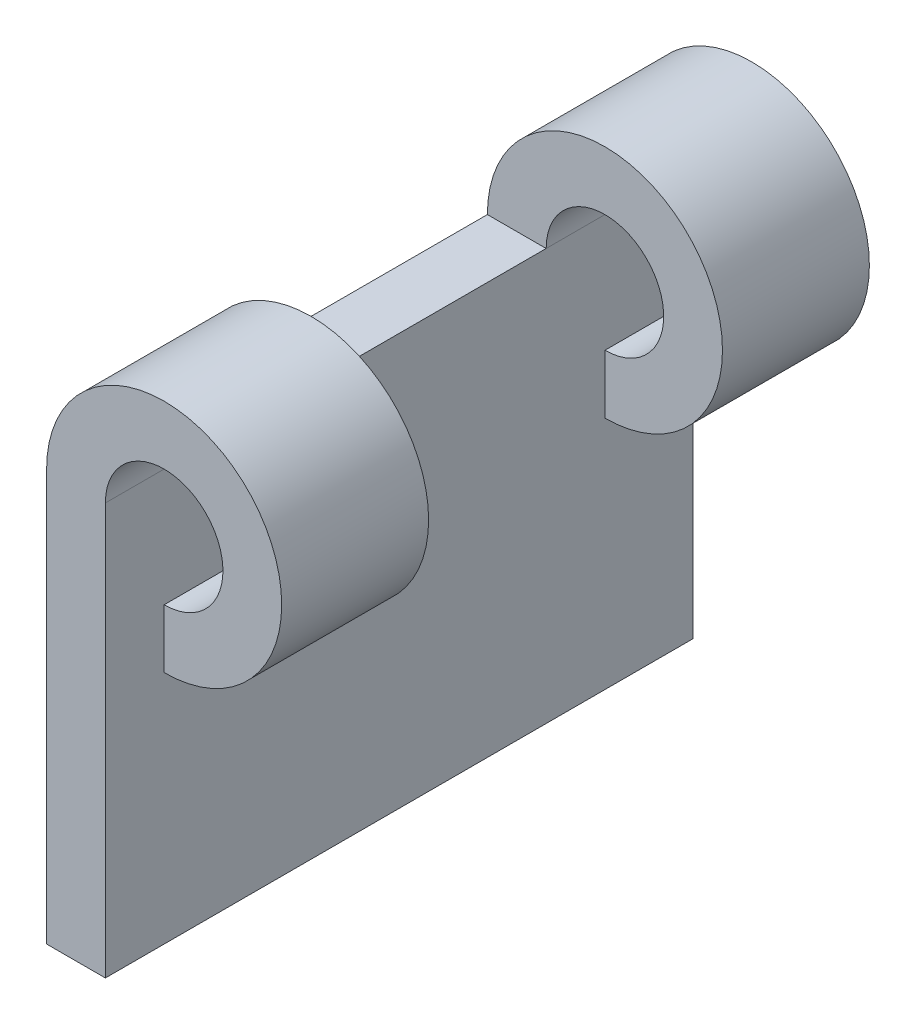
ISO-10303-21;
HEADER;
FILE_DESCRIPTION(('STEP AP214'),'2;1');
FILE_NAME('part.step','',(''),(''),'','','');
FILE_SCHEMA(('AUTOMOTIVE_DESIGN { 1 0 10303 214 1 1 1 1 }'));
ENDSEC;
DATA;
#1=APPLICATION_CONTEXT('core data for automotive mechanical design processes');
#2=APPLICATION_PROTOCOL_DEFINITION('international standard','automotive_design',2000,#1);
#3=PRODUCT_CONTEXT('',#1,'mechanical');
#4=PRODUCT('Part','Part','',(#3));
#5=PRODUCT_RELATED_PRODUCT_CATEGORY('part','',(#4));
#6=PRODUCT_DEFINITION_FORMATION('','',#4);
#7=PRODUCT_DEFINITION_CONTEXT('part definition',#1,'design');
#8=PRODUCT_DEFINITION('design','',#6,#7);
#9=PRODUCT_DEFINITION_SHAPE('','',#8);
#10=(LENGTH_UNIT() NAMED_UNIT(*) SI_UNIT(.MILLI.,.METRE.));
#11=(NAMED_UNIT(*) PLANE_ANGLE_UNIT() SI_UNIT($,.RADIAN.));
#12=(NAMED_UNIT(*) SI_UNIT($,.STERADIAN.) SOLID_ANGLE_UNIT());
#13=UNCERTAINTY_MEASURE_WITH_UNIT(LENGTH_MEASURE(1.E-05),#10,'distance_accuracy_value','');
#14=(GEOMETRIC_REPRESENTATION_CONTEXT(3) GLOBAL_UNCERTAINTY_ASSIGNED_CONTEXT((#13)) GLOBAL_UNIT_ASSIGNED_CONTEXT((#10,
#11,#12)) REPRESENTATION_CONTEXT('',''));
#15=CARTESIAN_POINT('',(0.,0.,0.));
#16=DIRECTION('',(0.,0.,1.));
#17=DIRECTION('',(1.,0.,0.));
#18=AXIS2_PLACEMENT_3D('',#15,#16,#17);
#19=CARTESIAN_POINT('',(4.,14.,5.));
#20=DIRECTION('',(0.,0.,-1.));
#21=DIRECTION('',(-1.,0.,0.));
#22=AXIS2_PLACEMENT_3D('',#19,#20,#21);
#23=CYLINDRICAL_SURFACE('',#22,2.);
#24=CARTESIAN_POINT('',(4.,14.,0.));
#25=DIRECTION('',(0.,0.,1.));
#26=DIRECTION('',(1.,0.,0.));
#27=AXIS2_PLACEMENT_3D('',#24,#25,#26);
#28=CIRCLE('',#27,2.);
#29=CARTESIAN_POINT('',(4.,12.,0.));
#30=VERTEX_POINT('',#29);
#31=CARTESIAN_POINT('',(2.,14.,0.));
#32=VERTEX_POINT('',#31);
#33=EDGE_CURVE('E119',#30,#32,#28,.T.);
#34=ORIENTED_EDGE('',*,*,#33,.F.);
#35=DIRECTION('',(0.,0.,-1.));
#36=VECTOR('',#35,1.);
#37=CARTESIAN_POINT('',(4.,12.,5.));
#38=LINE('',#37,#36);
#39=CARTESIAN_POINT('',(4.,12.,5.));
#40=VERTEX_POINT('',#39);
#41=EDGE_CURVE('E12',#40,#30,#38,.T.);
#42=ORIENTED_EDGE('',*,*,#41,.F.);
#43=CARTESIAN_POINT('',(4.,14.,5.));
#44=DIRECTION('',(0.,0.,1.));
#45=DIRECTION('',(1.,0.,0.));
#46=AXIS2_PLACEMENT_3D('',#43,#44,#45);
#47=CIRCLE('',#46,2.);
#48=CARTESIAN_POINT('',(2.,14.,5.));
#49=VERTEX_POINT('',#48);
#50=EDGE_CURVE('E107',#40,#49,#47,.T.);
#51=ORIENTED_EDGE('',*,*,#50,.T.);
#52=DIRECTION('',(0.,0.,-1.));
#53=VECTOR('',#52,1.);
#54=CARTESIAN_POINT('',(2.,14.,5.));
#55=LINE('',#54,#53);
#56=EDGE_CURVE('E96',#49,#32,#55,.T.);
#57=ORIENTED_EDGE('',*,*,#56,.T.);
#58=EDGE_LOOP('',(#34,#42,#51,#57));
#59=FACE_BOUND('',#58,.T.);
#60=ADVANCED_FACE('F57',(#59),#23,.F.);
#61=CARTESIAN_POINT('',(4.,0.,5.));
#62=DIRECTION('',(1.,0.,0.));
#63=DIRECTION('',(0.,0.,-1.));
#64=AXIS2_PLACEMENT_3D('',#61,#62,#63);
#65=PLANE('',#64);
#66=DIRECTION('',(0.,-1.,0.));
#67=VECTOR('',#66,1.);
#68=CARTESIAN_POINT('',(4.,0.,0.));
#69=LINE('',#68,#67);
#70=CARTESIAN_POINT('',(4.,10.,0.));
#71=VERTEX_POINT('',#70);
#72=EDGE_CURVE('E112',#30,#71,#69,.T.);
#73=ORIENTED_EDGE('',*,*,#72,.T.);
#74=DIRECTION('',(0.,0.,-1.));
#75=VECTOR('',#74,1.);
#76=CARTESIAN_POINT('',(4.,10.,5.));
#77=LINE('',#76,#75);
#78=CARTESIAN_POINT('',(4.,10.,5.));
#79=VERTEX_POINT('',#78);
#80=EDGE_CURVE('E65',#79,#71,#77,.T.);
#81=ORIENTED_EDGE('',*,*,#80,.F.);
#82=DIRECTION('',(0.,-1.,0.));
#83=VECTOR('',#82,1.);
#84=CARTESIAN_POINT('',(4.,0.,5.));
#85=LINE('',#84,#83);
#86=EDGE_CURVE('E102',#40,#79,#85,.T.);
#87=ORIENTED_EDGE('',*,*,#86,.F.);
#88=ORIENTED_EDGE('',*,*,#41,.T.);
#89=EDGE_LOOP('',(#73,#81,#87,#88));
#90=FACE_BOUND('',#89,.T.);
#91=ADVANCED_FACE('F110',(#90),#65,.F.);
#92=CARTESIAN_POINT('',(4.,14.,5.));
#93=DIRECTION('',(0.,0.,-1.));
#94=DIRECTION('',(-1.,0.,0.));
#95=AXIS2_PLACEMENT_3D('',#92,#93,#94);
#96=CYLINDRICAL_SURFACE('',#95,4.);
#97=CARTESIAN_POINT('',(4.,14.,0.));
#98=DIRECTION('',(0.,0.,1.));
#99=DIRECTION('',(1.,0.,0.));
#100=AXIS2_PLACEMENT_3D('',#97,#98,#99);
#101=CIRCLE('',#100,4.);
#102=CARTESIAN_POINT('',(0.,14.,0.));
#103=VERTEX_POINT('',#102);
#104=EDGE_CURVE('E89',#71,#103,#101,.T.);
#105=ORIENTED_EDGE('',*,*,#104,.T.);
#106=DIRECTION('',(0.,0.,-1.));
#107=VECTOR('',#106,1.);
#108=CARTESIAN_POINT('',(0.,14.,5.));
#109=LINE('',#108,#107);
#110=CARTESIAN_POINT('',(0.,14.,5.));
#111=VERTEX_POINT('',#110);
#112=EDGE_CURVE('E113',#111,#103,#109,.T.);
#113=ORIENTED_EDGE('',*,*,#112,.F.);
#114=CARTESIAN_POINT('',(4.,14.,5.));
#115=DIRECTION('',(0.,0.,1.));
#116=DIRECTION('',(1.,0.,0.));
#117=AXIS2_PLACEMENT_3D('',#114,#115,#116);
#118=CIRCLE('',#117,4.);
#119=EDGE_CURVE('E106',#79,#111,#118,.T.);
#120=ORIENTED_EDGE('',*,*,#119,.F.);
#121=ORIENTED_EDGE('',*,*,#80,.T.);
#122=EDGE_LOOP('',(#105,#113,#120,#121));
#123=FACE_BOUND('',#122,.T.);
#124=ADVANCED_FACE('F114',(#123),#96,.T.);
#125=CARTESIAN_POINT('',(0.,14.,5.));
#126=DIRECTION('',(0.,1.,0.));
#127=DIRECTION('',(0.,0.,1.));
#128=AXIS2_PLACEMENT_3D('',#125,#126,#127);
#129=PLANE('',#128);
#130=DIRECTION('',(1.,0.,0.));
#131=VECTOR('',#130,1.);
#132=CARTESIAN_POINT('',(0.,14.,0.));
#133=LINE('',#132,#131);
#134=EDGE_CURVE('E124',#103,#32,#133,.T.);
#135=ORIENTED_EDGE('',*,*,#134,.T.);
#136=ORIENTED_EDGE('',*,*,#56,.F.);
#137=DIRECTION('',(1.,0.,0.));
#138=VECTOR('',#137,1.);
#139=CARTESIAN_POINT('',(0.,14.,5.));
#140=LINE('',#139,#138);
#141=EDGE_CURVE('E73',#111,#49,#140,.T.);
#142=ORIENTED_EDGE('',*,*,#141,.F.);
#143=ORIENTED_EDGE('',*,*,#112,.T.);
#144=EDGE_LOOP('',(#135,#136,#142,#143));
#145=FACE_BOUND('',#144,.T.);
#146=ADVANCED_FACE('F129',(#145),#129,.F.);
#147=CARTESIAN_POINT('',(0.,0.,5.));
#148=DIRECTION('',(0.,0.,1.));
#149=DIRECTION('',(1.,0.,0.));
#150=AXIS2_PLACEMENT_3D('',#147,#148,#149);
#151=PLANE('',#150);
#152=ORIENTED_EDGE('',*,*,#50,.F.);
#153=ORIENTED_EDGE('',*,*,#86,.T.);
#154=ORIENTED_EDGE('',*,*,#119,.T.);
#155=ORIENTED_EDGE('',*,*,#141,.T.);
#156=EDGE_LOOP('',(#152,#153,#154,#155));
#157=FACE_BOUND('',#156,.T.);
#158=ADVANCED_FACE('F104',(#157),#151,.T.);
#159=CARTESIAN_POINT('',(0.,0.,0.));
#160=DIRECTION('',(0.,0.,1.));
#161=DIRECTION('',(1.,0.,0.));
#162=AXIS2_PLACEMENT_3D('',#159,#160,#161);
#163=PLANE('',#162);
#164=ORIENTED_EDGE('',*,*,#33,.T.);
#165=ORIENTED_EDGE('',*,*,#134,.F.);
#166=ORIENTED_EDGE('',*,*,#104,.F.);
#167=ORIENTED_EDGE('',*,*,#72,.F.);
#168=EDGE_LOOP('',(#164,#165,#166,#167));
#169=FACE_BOUND('',#168,.T.);
#170=ADVANCED_FACE('F131',(#169),#163,.F.);
#171=CLOSED_SHELL('',(#60,#91,#124,#146,#158,#170));
#172=MANIFOLD_SOLID_BREP('B2',#171);
#173=CARTESIAN_POINT('',(0.,14.,20.));
#174=DIRECTION('',(0.,1.,0.));
#175=DIRECTION('',(0.,0.,1.));
#176=AXIS2_PLACEMENT_3D('',#173,#174,#175);
#177=PLANE('',#176);
#178=DIRECTION('',(0.,0.,-1.));
#179=VECTOR('',#178,1.);
#180=CARTESIAN_POINT('',(0.,14.,20.));
#181=LINE('',#180,#179);
#182=CARTESIAN_POINT('',(0.,14.,15.));
#183=VERTEX_POINT('',#182);
#184=CARTESIAN_POINT('',(0.,14.,0.));
#185=VERTEX_POINT('',#184);
#186=EDGE_CURVE('E202',#183,#185,#181,.T.);
#187=ORIENTED_EDGE('',*,*,#186,.F.);
#188=DIRECTION('',(1.,0.,0.));
#189=VECTOR('',#188,1.);
#190=CARTESIAN_POINT('',(0.,14.,15.));
#191=LINE('',#190,#189);
#192=CARTESIAN_POINT('',(2.,14.,15.));
#193=VERTEX_POINT('',#192);
#194=EDGE_CURVE('E197',#183,#193,#191,.T.);
#195=ORIENTED_EDGE('',*,*,#194,.T.);
#196=DIRECTION('',(0.,0.,-1.));
#197=VECTOR('',#196,1.);
#198=CARTESIAN_POINT('',(2.,14.,20.));
#199=LINE('',#198,#197);
#200=CARTESIAN_POINT('',(2.,14.,0.));
#201=VERTEX_POINT('',#200);
#202=EDGE_CURVE('E315',#193,#201,#199,.T.);
#203=ORIENTED_EDGE('',*,*,#202,.T.);
#204=DIRECTION('',(1.,0.,0.));
#205=VECTOR('',#204,1.);
#206=CARTESIAN_POINT('',(0.,14.,0.));
#207=LINE('',#206,#205);
#208=EDGE_CURVE('E304',#185,#201,#207,.T.);
#209=ORIENTED_EDGE('',*,*,#208,.F.);
#210=EDGE_LOOP('',(#187,#195,#203,#209));
#211=FACE_BOUND('',#210,.T.);
#212=ADVANCED_FACE('F181',(#211),#177,.T.);
#213=CARTESIAN_POINT('',(0.,0.,20.));
#214=DIRECTION('',(0.,-1.,0.));
#215=DIRECTION('',(0.,0.,-1.));
#216=AXIS2_PLACEMENT_3D('',#213,#214,#215);
#217=PLANE('',#216);
#218=DIRECTION('',(-1.,0.,0.));
#219=VECTOR('',#218,1.);
#220=CARTESIAN_POINT('',(0.,0.,0.));
#221=LINE('',#220,#219);
#222=CARTESIAN_POINT('',(2.,0.,0.));
#223=VERTEX_POINT('',#222);
#224=CARTESIAN_POINT('',(0.,0.,0.));
#225=VERTEX_POINT('',#224);
#226=EDGE_CURVE('E250',#223,#225,#221,.T.);
#227=ORIENTED_EDGE('',*,*,#226,.F.);
#228=DIRECTION('',(0.,0.,-1.));
#229=VECTOR('',#228,1.);
#230=CARTESIAN_POINT('',(2.,0.,20.));
#231=LINE('',#230,#229);
#232=CARTESIAN_POINT('',(2.,0.,20.));
#233=VERTEX_POINT('',#232);
#234=EDGE_CURVE('E55',#233,#223,#231,.T.);
#235=ORIENTED_EDGE('',*,*,#234,.F.);
#236=DIRECTION('',(-1.,0.,0.));
#237=VECTOR('',#236,1.);
#238=CARTESIAN_POINT('',(0.,0.,20.));
#239=LINE('',#238,#237);
#240=CARTESIAN_POINT('',(0.,0.,20.));
#241=VERTEX_POINT('',#240);
#242=EDGE_CURVE('E286',#233,#241,#239,.T.);
#243=ORIENTED_EDGE('',*,*,#242,.T.);
#244=DIRECTION('',(0.,0.,-1.));
#245=VECTOR('',#244,1.);
#246=CARTESIAN_POINT('',(0.,0.,20.));
#247=LINE('',#246,#245);
#248=EDGE_CURVE('E296',#241,#225,#247,.T.);
#249=ORIENTED_EDGE('',*,*,#248,.T.);
#250=EDGE_LOOP('',(#227,#235,#243,#249));
#251=FACE_BOUND('',#250,.T.);
#252=ADVANCED_FACE('F183',(#251),#217,.T.);
#253=CARTESIAN_POINT('',(2.,0.,20.));
#254=DIRECTION('',(1.,0.,0.));
#255=DIRECTION('',(0.,0.,-1.));
#256=AXIS2_PLACEMENT_3D('',#253,#254,#255);
#257=PLANE('',#256);
#258=DIRECTION('',(0.,-1.,0.));
#259=VECTOR('',#258,1.);
#260=CARTESIAN_POINT('',(2.,0.,0.));
#261=LINE('',#260,#259);
#262=EDGE_CURVE('E300',#201,#223,#261,.T.);
#263=ORIENTED_EDGE('',*,*,#262,.F.);
#264=ORIENTED_EDGE('',*,*,#202,.F.);
#265=CARTESIAN_POINT('',(2.,14.,20.));
#266=VERTEX_POINT('',#265);
#267=EDGE_CURVE('E190',#266,#193,#199,.T.);
#268=ORIENTED_EDGE('',*,*,#267,.F.);
#269=DIRECTION('',(0.,-1.,0.));
#270=VECTOR('',#269,1.);
#271=CARTESIAN_POINT('',(2.,0.,20.));
#272=LINE('',#271,#270);
#273=EDGE_CURVE('E266',#266,#233,#272,.T.);
#274=ORIENTED_EDGE('',*,*,#273,.T.);
#275=ORIENTED_EDGE('',*,*,#234,.T.);
#276=EDGE_LOOP('',(#263,#264,#268,#274,#275));
#277=FACE_BOUND('',#276,.T.);
#278=ADVANCED_FACE('F320',(#277),#257,.T.);
#279=CARTESIAN_POINT('',(0.,0.,20.));
#280=DIRECTION('',(-1.,0.,0.));
#281=DIRECTION('',(0.,0.,1.));
#282=AXIS2_PLACEMENT_3D('',#279,#280,#281);
#283=PLANE('',#282);
#284=DIRECTION('',(0.,1.,0.));
#285=VECTOR('',#284,1.);
#286=CARTESIAN_POINT('',(0.,0.,0.));
#287=LINE('',#286,#285);
#288=EDGE_CURVE('E290',#225,#185,#287,.T.);
#289=ORIENTED_EDGE('',*,*,#288,.F.);
#290=ORIENTED_EDGE('',*,*,#248,.F.);
#291=DIRECTION('',(0.,1.,0.));
#292=VECTOR('',#291,1.);
#293=CARTESIAN_POINT('',(0.,0.,20.));
#294=LINE('',#293,#292);
#295=CARTESIAN_POINT('',(0.,14.,20.));
#296=VERTEX_POINT('',#295);
#297=EDGE_CURVE('E293',#241,#296,#294,.T.);
#298=ORIENTED_EDGE('',*,*,#297,.T.);
#299=EDGE_CURVE('E313',#296,#183,#181,.T.);
#300=ORIENTED_EDGE('',*,*,#299,.T.);
#301=ORIENTED_EDGE('',*,*,#186,.T.);
#302=EDGE_LOOP('',(#289,#290,#298,#300,#301));
#303=FACE_BOUND('',#302,.T.);
#304=ADVANCED_FACE('F326',(#303),#283,.T.);
#305=CARTESIAN_POINT('',(0.,0.,20.));
#306=DIRECTION('',(0.,0.,1.));
#307=DIRECTION('',(1.,0.,0.));
#308=AXIS2_PLACEMENT_3D('',#305,#306,#307);
#309=PLANE('',#308);
#310=ORIENTED_EDGE('',*,*,#242,.F.);
#311=ORIENTED_EDGE('',*,*,#273,.F.);
#312=CARTESIAN_POINT('',(4.,14.,20.));
#313=DIRECTION('',(0.,0.,1.));
#314=DIRECTION('',(1.,0.,0.));
#315=AXIS2_PLACEMENT_3D('',#312,#313,#314);
#316=CIRCLE('',#315,2.);
#317=CARTESIAN_POINT('',(4.,12.,20.));
#318=VERTEX_POINT('',#317);
#319=EDGE_CURVE('E244',#318,#266,#316,.T.);
#320=ORIENTED_EDGE('',*,*,#319,.F.);
#321=DIRECTION('',(0.,-1.,0.));
#322=VECTOR('',#321,1.);
#323=CARTESIAN_POINT('',(4.,0.,20.));
#324=LINE('',#323,#322);
#325=CARTESIAN_POINT('',(4.,10.,20.));
#326=VERTEX_POINT('',#325);
#327=EDGE_CURVE('E254',#318,#326,#324,.T.);
#328=ORIENTED_EDGE('',*,*,#327,.T.);
#329=CARTESIAN_POINT('',(4.,14.,20.));
#330=DIRECTION('',(0.,0.,1.));
#331=DIRECTION('',(1.,0.,0.));
#332=AXIS2_PLACEMENT_3D('',#329,#330,#331);
#333=CIRCLE('',#332,4.);
#334=EDGE_CURVE('E261',#326,#296,#333,.T.);
#335=ORIENTED_EDGE('',*,*,#334,.T.);
#336=ORIENTED_EDGE('',*,*,#297,.F.);
#337=EDGE_LOOP('',(#310,#311,#320,#328,#335,#336));
#338=FACE_BOUND('',#337,.T.);
#339=ADVANCED_FACE('F264',(#338),#309,.T.);
#340=CARTESIAN_POINT('',(0.,0.,0.));
#341=DIRECTION('',(0.,0.,1.));
#342=DIRECTION('',(1.,0.,0.));
#343=AXIS2_PLACEMENT_3D('',#340,#341,#342);
#344=PLANE('',#343);
#345=ORIENTED_EDGE('',*,*,#226,.T.);
#346=ORIENTED_EDGE('',*,*,#288,.T.);
#347=ORIENTED_EDGE('',*,*,#208,.T.);
#348=ORIENTED_EDGE('',*,*,#262,.T.);
#349=EDGE_LOOP('',(#345,#346,#347,#348));
#350=FACE_BOUND('',#349,.T.);
#351=ADVANCED_FACE('F323',(#350),#344,.F.);
#352=CARTESIAN_POINT('',(4.,14.,20.));
#353=DIRECTION('',(0.,0.,-1.));
#354=DIRECTION('',(-1.,0.,0.));
#355=AXIS2_PLACEMENT_3D('',#352,#353,#354);
#356=CYLINDRICAL_SURFACE('',#355,2.);
#357=CARTESIAN_POINT('',(4.,14.,15.));
#358=DIRECTION('',(0.,0.,1.));
#359=DIRECTION('',(1.,0.,0.));
#360=AXIS2_PLACEMENT_3D('',#357,#358,#359);
#361=CIRCLE('',#360,2.);
#362=CARTESIAN_POINT('',(4.,12.,15.));
#363=VERTEX_POINT('',#362);
#364=EDGE_CURVE('E246',#363,#193,#361,.T.);
#365=ORIENTED_EDGE('',*,*,#364,.F.);
#366=DIRECTION('',(0.,0.,-1.));
#367=VECTOR('',#366,1.);
#368=CARTESIAN_POINT('',(4.,12.,20.));
#369=LINE('',#368,#367);
#370=EDGE_CURVE('E239',#318,#363,#369,.T.);
#371=ORIENTED_EDGE('',*,*,#370,.F.);
#372=ORIENTED_EDGE('',*,*,#319,.T.);
#373=ORIENTED_EDGE('',*,*,#267,.T.);
#374=EDGE_LOOP('',(#365,#371,#372,#373));
#375=FACE_BOUND('',#374,.T.);
#376=ADVANCED_FACE('F241',(#375),#356,.F.);
#377=CARTESIAN_POINT('',(4.,0.,20.));
#378=DIRECTION('',(1.,0.,0.));
#379=DIRECTION('',(0.,0.,-1.));
#380=AXIS2_PLACEMENT_3D('',#377,#378,#379);
#381=PLANE('',#380);
#382=DIRECTION('',(0.,-1.,0.));
#383=VECTOR('',#382,1.);
#384=CARTESIAN_POINT('',(4.,0.,15.));
#385=LINE('',#384,#383);
#386=CARTESIAN_POINT('',(4.,10.,15.));
#387=VERTEX_POINT('',#386);
#388=EDGE_CURVE('E278',#363,#387,#385,.T.);
#389=ORIENTED_EDGE('',*,*,#388,.T.);
#390=DIRECTION('',(0.,0.,-1.));
#391=VECTOR('',#390,1.);
#392=CARTESIAN_POINT('',(4.,10.,20.));
#393=LINE('',#392,#391);
#394=EDGE_CURVE('E251',#326,#387,#393,.T.);
#395=ORIENTED_EDGE('',*,*,#394,.F.);
#396=ORIENTED_EDGE('',*,*,#327,.F.);
#397=ORIENTED_EDGE('',*,*,#370,.T.);
#398=EDGE_LOOP('',(#389,#395,#396,#397));
#399=FACE_BOUND('',#398,.T.);
#400=ADVANCED_FACE('F255',(#399),#381,.F.);
#401=CARTESIAN_POINT('',(4.,14.,20.));
#402=DIRECTION('',(0.,0.,-1.));
#403=DIRECTION('',(-1.,0.,0.));
#404=AXIS2_PLACEMENT_3D('',#401,#402,#403);
#405=CYLINDRICAL_SURFACE('',#404,4.);
#406=CARTESIAN_POINT('',(4.,14.,15.));
#407=DIRECTION('',(0.,0.,1.));
#408=DIRECTION('',(1.,0.,0.));
#409=AXIS2_PLACEMENT_3D('',#406,#407,#408);
#410=CIRCLE('',#409,4.);
#411=EDGE_CURVE('E271',#387,#183,#410,.T.);
#412=ORIENTED_EDGE('',*,*,#411,.T.);
#413=ORIENTED_EDGE('',*,*,#299,.F.);
#414=ORIENTED_EDGE('',*,*,#334,.F.);
#415=ORIENTED_EDGE('',*,*,#394,.T.);
#416=EDGE_LOOP('',(#412,#413,#414,#415));
#417=FACE_BOUND('',#416,.T.);
#418=ADVANCED_FACE('F332',(#417),#405,.T.);
#419=CARTESIAN_POINT('',(0.,0.,15.));
#420=DIRECTION('',(0.,0.,1.));
#421=DIRECTION('',(1.,0.,0.));
#422=AXIS2_PLACEMENT_3D('',#419,#420,#421);
#423=PLANE('',#422);
#424=ORIENTED_EDGE('',*,*,#364,.T.);
#425=ORIENTED_EDGE('',*,*,#194,.F.);
#426=ORIENTED_EDGE('',*,*,#411,.F.);
#427=ORIENTED_EDGE('',*,*,#388,.F.);
#428=EDGE_LOOP('',(#424,#425,#426,#427));
#429=FACE_BOUND('',#428,.T.);
#430=ADVANCED_FACE('F334',(#429),#423,.F.);
#431=CLOSED_SHELL('',(#212,#252,#278,#304,#339,#351,#376,#400,#418,#430));
#432=MANIFOLD_SOLID_BREP('B6',#431);
#433=ADVANCED_BREP_SHAPE_REPRESENTATION('',(#18,#172,#432),#14);
#434=SHAPE_DEFINITION_REPRESENTATION(#9,#433);
ENDSEC;
END-ISO-10303-21;
